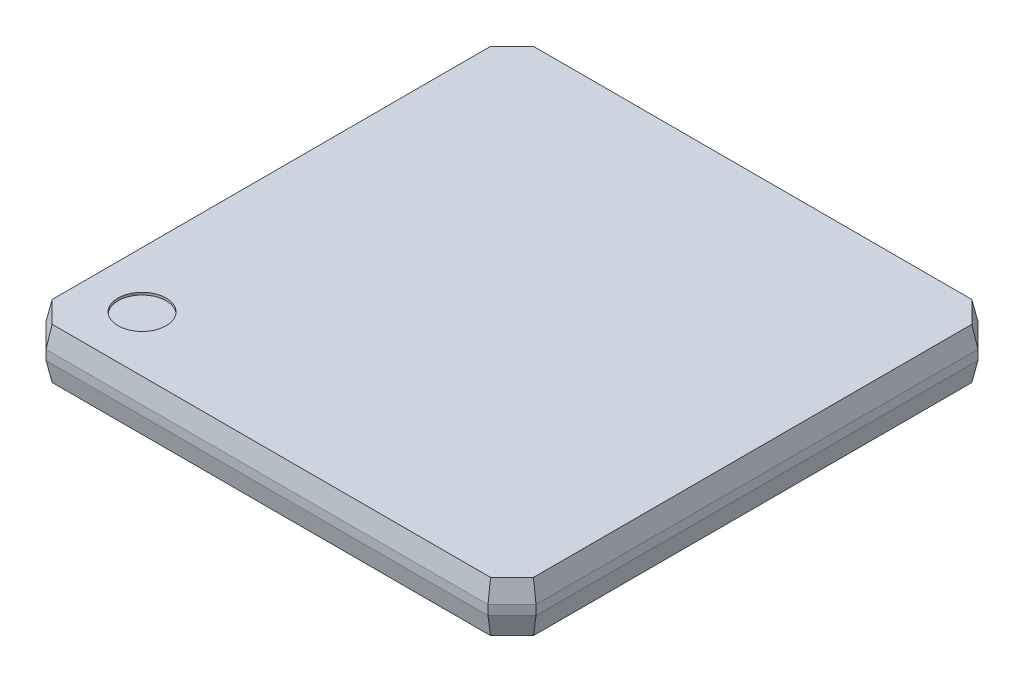
ISO-10303-21;
HEADER;
FILE_DESCRIPTION(('STEP AP214'),'2;1');
FILE_NAME('part.step','',(''),(''),'','','');
FILE_SCHEMA(('AUTOMOTIVE_DESIGN { 1 0 10303 214 1 1 1 1 }'));
ENDSEC;
DATA;
#1=APPLICATION_CONTEXT('core data for automotive mechanical design processes');
#2=APPLICATION_PROTOCOL_DEFINITION('international standard','automotive_design',2000,#1);
#3=PRODUCT_CONTEXT('',#1,'mechanical');
#4=PRODUCT('Part','Part','',(#3));
#5=PRODUCT_RELATED_PRODUCT_CATEGORY('part','',(#4));
#6=PRODUCT_DEFINITION_FORMATION('','',#4);
#7=PRODUCT_DEFINITION_CONTEXT('part definition',#1,'design');
#8=PRODUCT_DEFINITION('design','',#6,#7);
#9=PRODUCT_DEFINITION_SHAPE('','',#8);
#10=(LENGTH_UNIT() NAMED_UNIT(*) SI_UNIT(.MILLI.,.METRE.));
#11=(NAMED_UNIT(*) PLANE_ANGLE_UNIT() SI_UNIT($,.RADIAN.));
#12=(NAMED_UNIT(*) SI_UNIT($,.STERADIAN.) SOLID_ANGLE_UNIT());
#13=UNCERTAINTY_MEASURE_WITH_UNIT(LENGTH_MEASURE(1.E-05),#10,'distance_accuracy_value','');
#14=(GEOMETRIC_REPRESENTATION_CONTEXT(3) GLOBAL_UNCERTAINTY_ASSIGNED_CONTEXT((#13)) GLOBAL_UNIT_ASSIGNED_CONTEXT((#10,
#11,#12)) REPRESENTATION_CONTEXT('',''));
#15=CARTESIAN_POINT('',(0.,0.,0.));
#16=DIRECTION('',(0.,0.,1.));
#17=DIRECTION('',(1.,0.,0.));
#18=AXIS2_PLACEMENT_3D('',#15,#16,#17);
#19=CARTESIAN_POINT('',(-3.85,0.475,3.85));
#20=DIRECTION('',(0.,1.,0.));
#21=DIRECTION('',(0.,0.,1.));
#22=AXIS2_PLACEMENT_3D('',#19,#20,#21);
#23=PLANE('',#22);
#24=CARTESIAN_POINT('',(-3.85,0.475,3.85));
#25=DIRECTION('',(0.,1.,0.));
#26=DIRECTION('',(0.,0.,1.));
#27=AXIS2_PLACEMENT_3D('',#24,#25,#26);
#28=CIRCLE('',#27,0.500000000000001);
#29=CARTESIAN_POINT('',(-3.85,0.475,4.35));
#30=VERTEX_POINT('',#29);
#31=EDGE_CURVE('E19',#30,#30,#28,.T.);
#32=ORIENTED_EDGE('',*,*,#31,.T.);
#33=EDGE_LOOP('',(#32));
#34=FACE_BOUND('',#33,.T.);
#35=ADVANCED_FACE('F16',(#34),#23,.T.);
#36=CARTESIAN_POINT('',(-3.85,0.475,3.85));
#37=DIRECTION('',(0.,1.,0.));
#38=DIRECTION('',(0.,0.,1.));
#39=AXIS2_PLACEMENT_3D('',#36,#37,#38);
#40=CYLINDRICAL_SURFACE('',#39,0.500000000000001);
#41=ORIENTED_EDGE('',*,*,#31,.F.);
#42=EDGE_LOOP('',(#41));
#43=FACE_BOUND('',#42,.T.);
#44=CARTESIAN_POINT('',(-3.85,0.525,3.85));
#45=DIRECTION('',(0.,1.,0.));
#46=DIRECTION('',(0.,0.,1.));
#47=AXIS2_PLACEMENT_3D('',#44,#45,#46);
#48=CIRCLE('',#47,0.500000000000001);
#49=CARTESIAN_POINT('',(-3.85,0.525,4.35));
#50=VERTEX_POINT('',#49);
#51=EDGE_CURVE('E146',#50,#50,#48,.T.);
#52=ORIENTED_EDGE('',*,*,#51,.T.);
#53=EDGE_LOOP('',(#52));
#54=FACE_BOUND('',#53,.T.);
#55=ADVANCED_FACE('F161',(#43,#54),#40,.F.);
#56=CARTESIAN_POINT('',(5.1,0.525,-5.1));
#57=DIRECTION('',(0.,-1.,0.));
#58=DIRECTION('',(0.,0.,-1.));
#59=AXIS2_PLACEMENT_3D('',#56,#57,#58);
#60=PLANE('',#59);
#61=ORIENTED_EDGE('',*,*,#51,.F.);
#62=EDGE_LOOP('',(#61));
#63=FACE_BOUND('',#62,.T.);
#64=DIRECTION('',(1.,0.,0.));
#65=VECTOR('',#64,1.);
#66=CARTESIAN_POINT('',(5.1,0.525,-5.00966346129024));
#67=LINE('',#66,#65);
#68=CARTESIAN_POINT('',(4.56258138048858,0.525,-5.00966346129024));
#69=VERTEX_POINT('',#68);
#70=CARTESIAN_POINT('',(-4.56258138048858,0.525,-5.00966346129024));
#71=VERTEX_POINT('',#70);
#72=EDGE_CURVE('E581',#69,#71,#67,.F.);
#73=ORIENTED_EDGE('',*,*,#72,.T.);
#74=DIRECTION('',(0.707106781186547,0.,-0.707106781186548));
#75=VECTOR('',#74,1.);
#76=CARTESIAN_POINT('',(0.313877579110583,0.525,-9.88612242088941));
#77=LINE('',#76,#75);
#78=CARTESIAN_POINT('',(-5.00966346129024,0.525,-4.56258138048857));
#79=VERTEX_POINT('',#78);
#80=EDGE_CURVE('E538',#71,#79,#77,.F.);
#81=ORIENTED_EDGE('',*,*,#80,.T.);
#82=DIRECTION('',(0.,0.,1.));
#83=VECTOR('',#82,1.);
#84=CARTESIAN_POINT('',(-5.00966346129024,0.525,-5.1));
#85=LINE('',#84,#83);
#86=CARTESIAN_POINT('',(-5.00966346129024,0.525,4.56258138048858));
#87=VERTEX_POINT('',#86);
#88=EDGE_CURVE('E137',#79,#87,#85,.T.);
#89=ORIENTED_EDGE('',*,*,#88,.T.);
#90=DIRECTION('',(-0.707106781186548,0.,-0.707106781186548));
#91=VECTOR('',#90,1.);
#92=CARTESIAN_POINT('',(-4.78612242088941,0.525,4.78612242088941));
#93=LINE('',#92,#91);
#94=CARTESIAN_POINT('',(-4.56258138048858,0.525,5.00966346129024));
#95=VERTEX_POINT('',#94);
#96=EDGE_CURVE('E127',#87,#95,#93,.F.);
#97=ORIENTED_EDGE('',*,*,#96,.T.);
#98=DIRECTION('',(1.,0.,0.));
#99=VECTOR('',#98,1.);
#100=CARTESIAN_POINT('',(5.1,0.525,5.00966346129024));
#101=LINE('',#100,#99);
#102=CARTESIAN_POINT('',(4.56258138048858,0.525,5.00966346129024));
#103=VERTEX_POINT('',#102);
#104=EDGE_CURVE('E134',#95,#103,#101,.T.);
#105=ORIENTED_EDGE('',*,*,#104,.T.);
#106=DIRECTION('',(-0.707106781186548,0.,0.707106781186548));
#107=VECTOR('',#106,1.);
#108=CARTESIAN_POINT('',(5.00966346129024,0.525,4.56258138048858));
#109=LINE('',#108,#107);
#110=CARTESIAN_POINT('',(5.00966346129024,0.525,4.56258138048858));
#111=VERTEX_POINT('',#110);
#112=EDGE_CURVE('E157',#111,#103,#109,.T.);
#113=ORIENTED_EDGE('',*,*,#112,.F.);
#114=DIRECTION('',(0.,0.,1.));
#115=VECTOR('',#114,1.);
#116=CARTESIAN_POINT('',(5.00966346129024,0.525,-5.1));
#117=LINE('',#116,#115);
#118=CARTESIAN_POINT('',(5.00966346129024,0.525,-4.56258138048857));
#119=VERTEX_POINT('',#118);
#120=EDGE_CURVE('E575',#111,#119,#117,.F.);
#121=ORIENTED_EDGE('',*,*,#120,.T.);
#122=DIRECTION('',(0.707106781186547,0.,0.707106781186548));
#123=VECTOR('',#122,1.);
#124=CARTESIAN_POINT('',(4.78612242088941,0.525,-4.78612242088941));
#125=LINE('',#124,#123);
#126=EDGE_CURVE('E579',#119,#69,#125,.F.);
#127=ORIENTED_EDGE('',*,*,#126,.T.);
#128=EDGE_LOOP('',(#73,#81,#89,#97,#105,#113,#121,#127));
#129=FACE_BOUND('',#128,.T.);
#130=ADVANCED_FACE('F133',(#63,#129),#60,.F.);
#131=CARTESIAN_POINT('',(5.1,0.525,5.00966346129024));
#132=DIRECTION('',(0.,-0.207911690817756,-0.978147600733806));
#133=DIRECTION('',(0.,0.978147600733806,-0.207911690817756));
#134=AXIS2_PLACEMENT_3D('',#131,#132,#133);
#135=PLANE('',#134);
#136=DIRECTION('',(-0.0858022482493047,0.974540375409119,-0.207144951405574));
#137=VECTOR('',#136,1.);
#138=CARTESIAN_POINT('',(4.6,0.099999999999995,5.1));
#139=LINE('',#138,#137);
#140=CARTESIAN_POINT('',(4.6,0.0999999999999948,5.1));
#141=VERTEX_POINT('',#140);
#142=EDGE_CURVE('E145',#141,#103,#139,.T.);
#143=ORIENTED_EDGE('',*,*,#142,.T.);
#144=ORIENTED_EDGE('',*,*,#104,.F.);
#145=DIRECTION('',(-0.0858022482492987,-0.97454037540912,0.207144951405576));
#146=VECTOR('',#145,1.);
#147=CARTESIAN_POINT('',(-4.56258138048858,0.525,5.00966346129024));
#148=LINE('',#147,#146);
#149=CARTESIAN_POINT('',(-4.6,0.0999999999999947,5.1));
#150=VERTEX_POINT('',#149);
#151=EDGE_CURVE('E139',#95,#150,#148,.T.);
#152=ORIENTED_EDGE('',*,*,#151,.T.);
#153=DIRECTION('',(-1.,0.,0.));
#154=VECTOR('',#153,1.);
#155=CARTESIAN_POINT('',(-4.6,0.0999999999999947,5.1));
#156=LINE('',#155,#154);
#157=EDGE_CURVE('E568',#150,#141,#156,.F.);
#158=ORIENTED_EDGE('',*,*,#157,.T.);
#159=EDGE_LOOP('',(#143,#144,#152,#158));
#160=FACE_BOUND('',#159,.T.);
#161=ADVANCED_FACE('F142',(#160),#135,.F.);
#162=CARTESIAN_POINT('',(-4.78612242088941,0.525,4.78612242088941));
#163=DIRECTION('',(0.691654801480226,-0.207911690817754,-0.691654801480226));
#164=DIRECTION('',(-0.707106781186548,0.,-0.707106781186548));
#165=AXIS2_PLACEMENT_3D('',#162,#163,#164);
#166=PLANE('',#165);
#167=ORIENTED_EDGE('',*,*,#151,.F.);
#168=ORIENTED_EDGE('',*,*,#96,.F.);
#169=DIRECTION('',(-0.207144951405572,-0.97454037540912,0.0858022482492987));
#170=VECTOR('',#169,1.);
#171=CARTESIAN_POINT('',(-5.00966346129024,0.525,4.56258138048858));
#172=LINE('',#171,#170);
#173=CARTESIAN_POINT('',(-5.1,0.0999999999999947,4.6));
#174=VERTEX_POINT('',#173);
#175=EDGE_CURVE('E152',#87,#174,#172,.T.);
#176=ORIENTED_EDGE('',*,*,#175,.T.);
#177=DIRECTION('',(-0.707106781186548,0.,-0.707106781186548));
#178=VECTOR('',#177,1.);
#179=CARTESIAN_POINT('',(-5.1,0.0999999999999946,4.6));
#180=LINE('',#179,#178);
#181=EDGE_CURVE('E150',#174,#150,#180,.F.);
#182=ORIENTED_EDGE('',*,*,#181,.T.);
#183=EDGE_LOOP('',(#167,#168,#176,#182));
#184=FACE_BOUND('',#183,.T.);
#185=ADVANCED_FACE('F148',(#184),#166,.F.);
#186=CARTESIAN_POINT('',(-5.00966346129024,0.525,-5.1));
#187=DIRECTION('',(0.978147600733806,-0.207911690817756,0.));
#188=DIRECTION('',(0.207911690817756,0.978147600733806,0.));
#189=AXIS2_PLACEMENT_3D('',#186,#187,#188);
#190=PLANE('',#189);
#191=DIRECTION('',(-0.207144951405578,-0.974540375409119,-0.0858022482492987));
#192=VECTOR('',#191,1.);
#193=CARTESIAN_POINT('',(-5.00966346129024,0.525,-4.56258138048857));
#194=LINE('',#193,#192);
#195=CARTESIAN_POINT('',(-5.1,0.099999999999995,-4.6));
#196=VERTEX_POINT('',#195);
#197=EDGE_CURVE('E534',#79,#196,#194,.T.);
#198=ORIENTED_EDGE('',*,*,#197,.T.);
#199=DIRECTION('',(0.,0.,-1.));
#200=VECTOR('',#199,1.);
#201=CARTESIAN_POINT('',(-5.1,0.099999999999995,-4.6));
#202=LINE('',#201,#200);
#203=EDGE_CURVE('E537',#196,#174,#202,.F.);
#204=ORIENTED_EDGE('',*,*,#203,.T.);
#205=ORIENTED_EDGE('',*,*,#175,.F.);
#206=ORIENTED_EDGE('',*,*,#88,.F.);
#207=EDGE_LOOP('',(#198,#204,#205,#206));
#208=FACE_BOUND('',#207,.T.);
#209=ADVANCED_FACE('F262',(#208),#190,.F.);
#210=CARTESIAN_POINT('',(0.313877579110583,0.525,-9.88612242088941));
#211=DIRECTION('',(0.691654801480227,-0.207911690817755,0.691654801480226));
#212=DIRECTION('',(0.707106781186547,0.,-0.707106781186548));
#213=AXIS2_PLACEMENT_3D('',#210,#211,#212);
#214=PLANE('',#213);
#215=DIRECTION('',(-0.0858022482492988,-0.97454037540912,-0.207144951405572));
#216=VECTOR('',#215,1.);
#217=CARTESIAN_POINT('',(-4.56258138048858,0.525,-5.00966346129024));
#218=LINE('',#217,#216);
#219=CARTESIAN_POINT('',(-4.6,0.099999999999995,-5.1));
#220=VERTEX_POINT('',#219);
#221=EDGE_CURVE('E543',#71,#220,#218,.T.);
#222=ORIENTED_EDGE('',*,*,#221,.T.);
#223=DIRECTION('',(0.707106781186547,0.,-0.707106781186548));
#224=VECTOR('',#223,1.);
#225=CARTESIAN_POINT('',(-5.1,0.099999999999995,-4.6));
#226=LINE('',#225,#224);
#227=EDGE_CURVE('E541',#220,#196,#226,.F.);
#228=ORIENTED_EDGE('',*,*,#227,.T.);
#229=ORIENTED_EDGE('',*,*,#197,.F.);
#230=ORIENTED_EDGE('',*,*,#80,.F.);
#231=EDGE_LOOP('',(#222,#228,#229,#230));
#232=FACE_BOUND('',#231,.T.);
#233=ADVANCED_FACE('F258',(#232),#214,.F.);
#234=CARTESIAN_POINT('',(5.1,0.525,-5.00966346129024));
#235=DIRECTION('',(0.,-0.207911690817756,0.978147600733806));
#236=DIRECTION('',(0.,-0.978147600733806,-0.207911690817756));
#237=AXIS2_PLACEMENT_3D('',#234,#235,#236);
#238=PLANE('',#237);
#239=DIRECTION('',(0.0858022482493007,-0.97454037540912,-0.207144951405572));
#240=VECTOR('',#239,1.);
#241=CARTESIAN_POINT('',(4.56258138048858,0.525,-5.00966346129024));
#242=LINE('',#241,#240);
#243=CARTESIAN_POINT('',(4.6,0.0999999999999948,-5.1));
#244=VERTEX_POINT('',#243);
#245=EDGE_CURVE('E577',#69,#244,#242,.T.);
#246=ORIENTED_EDGE('',*,*,#245,.T.);
#247=DIRECTION('',(1.,0.,0.));
#248=VECTOR('',#247,1.);
#249=CARTESIAN_POINT('',(-4.6,0.0999999999999948,-5.1));
#250=LINE('',#249,#248);
#251=EDGE_CURVE('E559',#244,#220,#250,.F.);
#252=ORIENTED_EDGE('',*,*,#251,.T.);
#253=ORIENTED_EDGE('',*,*,#221,.F.);
#254=ORIENTED_EDGE('',*,*,#72,.F.);
#255=EDGE_LOOP('',(#246,#252,#253,#254));
#256=FACE_BOUND('',#255,.T.);
#257=ADVANCED_FACE('F254',(#256),#238,.F.);
#258=CARTESIAN_POINT('',(4.78612242088941,0.525,-4.78612242088941));
#259=DIRECTION('',(-0.691654801480227,-0.207911690817755,0.691654801480226));
#260=DIRECTION('',(0.707106781186547,0.,0.707106781186548));
#261=AXIS2_PLACEMENT_3D('',#258,#259,#260);
#262=PLANE('',#261);
#263=ORIENTED_EDGE('',*,*,#245,.F.);
#264=ORIENTED_EDGE('',*,*,#126,.F.);
#265=DIRECTION('',(0.20714495140557,-0.97454037540912,-0.0858022482493047));
#266=VECTOR('',#265,1.);
#267=CARTESIAN_POINT('',(5.00966346129024,0.525,-4.56258138048857));
#268=LINE('',#267,#266);
#269=CARTESIAN_POINT('',(5.1,0.0999999999999947,-4.6));
#270=VERTEX_POINT('',#269);
#271=EDGE_CURVE('E573',#119,#270,#268,.T.);
#272=ORIENTED_EDGE('',*,*,#271,.T.);
#273=DIRECTION('',(0.707106781186547,0.,0.707106781186548));
#274=VECTOR('',#273,1.);
#275=CARTESIAN_POINT('',(4.6,0.0999999999999947,-5.1));
#276=LINE('',#275,#274);
#277=EDGE_CURVE('E595',#270,#244,#276,.F.);
#278=ORIENTED_EDGE('',*,*,#277,.T.);
#279=EDGE_LOOP('',(#263,#264,#272,#278));
#280=FACE_BOUND('',#279,.T.);
#281=ADVANCED_FACE('F250',(#280),#262,.F.);
#282=CARTESIAN_POINT('',(5.00966346129024,0.525,-5.1));
#283=DIRECTION('',(-0.978147600733807,-0.207911690817754,0.));
#284=DIRECTION('',(0.207911690817754,-0.978147600733807,0.));
#285=AXIS2_PLACEMENT_3D('',#282,#283,#284);
#286=PLANE('',#285);
#287=ORIENTED_EDGE('',*,*,#271,.F.);
#288=ORIENTED_EDGE('',*,*,#120,.F.);
#289=DIRECTION('',(0.207144951405574,-0.974540375409119,0.0858022482493048));
#290=VECTOR('',#289,1.);
#291=CARTESIAN_POINT('',(5.00966346129024,0.525,4.56258138048858));
#292=LINE('',#291,#290);
#293=CARTESIAN_POINT('',(5.1,0.0999999999999949,4.6));
#294=VERTEX_POINT('',#293);
#295=EDGE_CURVE('E570',#111,#294,#292,.T.);
#296=ORIENTED_EDGE('',*,*,#295,.T.);
#297=DIRECTION('',(0.,0.,1.));
#298=VECTOR('',#297,1.);
#299=CARTESIAN_POINT('',(5.1,0.099999999999995,-4.6));
#300=LINE('',#299,#298);
#301=EDGE_CURVE('E600',#294,#270,#300,.F.);
#302=ORIENTED_EDGE('',*,*,#301,.T.);
#303=EDGE_LOOP('',(#287,#288,#296,#302));
#304=FACE_BOUND('',#303,.T.);
#305=ADVANCED_FACE('F246',(#304),#286,.F.);
#306=CARTESIAN_POINT('',(9.88612242088941,0.525,-0.313877579110589));
#307=DIRECTION('',(-0.691654801480226,-0.207911690817757,-0.691654801480226));
#308=DIRECTION('',(-0.707106781186547,0.,0.707106781186547));
#309=AXIS2_PLACEMENT_3D('',#306,#307,#308);
#310=PLANE('',#309);
#311=ORIENTED_EDGE('',*,*,#295,.F.);
#312=ORIENTED_EDGE('',*,*,#112,.T.);
#313=ORIENTED_EDGE('',*,*,#142,.F.);
#314=DIRECTION('',(-0.707106781186548,0.,0.707106781186548));
#315=VECTOR('',#314,1.);
#316=CARTESIAN_POINT('',(4.6,0.0999999999999946,5.1));
#317=LINE('',#316,#315);
#318=EDGE_CURVE('E639',#141,#294,#317,.F.);
#319=ORIENTED_EDGE('',*,*,#318,.T.);
#320=EDGE_LOOP('',(#311,#312,#313,#319));
#321=FACE_BOUND('',#320,.T.);
#322=ADVANCED_FACE('F242',(#321),#310,.F.);
#323=CARTESIAN_POINT('',(-4.6,0.525,5.1));
#324=DIRECTION('',(0.,0.,-1.));
#325=DIRECTION('',(-1.,0.,0.));
#326=AXIS2_PLACEMENT_3D('',#323,#324,#325);
#327=PLANE('',#326);
#328=DIRECTION('',(0.,1.,0.));
#329=VECTOR('',#328,1.);
#330=CARTESIAN_POINT('',(4.6,0.525,5.1));
#331=LINE('',#330,#329);
#332=CARTESIAN_POINT('',(4.6,-0.0999999999999951,5.1));
#333=VERTEX_POINT('',#332);
#334=EDGE_CURVE('E642',#333,#141,#331,.T.);
#335=ORIENTED_EDGE('',*,*,#334,.T.);
#336=ORIENTED_EDGE('',*,*,#157,.F.);
#337=DIRECTION('',(0.,1.,0.));
#338=VECTOR('',#337,1.);
#339=CARTESIAN_POINT('',(-4.6,0.525,5.1));
#340=LINE('',#339,#338);
#341=CARTESIAN_POINT('',(-4.6,-0.099999999999995,5.1));
#342=VERTEX_POINT('',#341);
#343=EDGE_CURVE('E553',#150,#342,#340,.F.);
#344=ORIENTED_EDGE('',*,*,#343,.T.);
#345=DIRECTION('',(1.,0.,0.));
#346=VECTOR('',#345,1.);
#347=CARTESIAN_POINT('',(-4.6,-0.099999999999995,5.1));
#348=LINE('',#347,#346);
#349=EDGE_CURVE('E634',#333,#342,#348,.F.);
#350=ORIENTED_EDGE('',*,*,#349,.F.);
#351=EDGE_LOOP('',(#335,#336,#344,#350));
#352=FACE_BOUND('',#351,.T.);
#353=ADVANCED_FACE('F238',(#352),#327,.F.);
#354=CARTESIAN_POINT('',(-5.1,0.525,4.6));
#355=DIRECTION('',(0.707106781186548,0.,-0.707106781186548));
#356=DIRECTION('',(-0.707106781186548,0.,-0.707106781186548));
#357=AXIS2_PLACEMENT_3D('',#354,#355,#356);
#358=PLANE('',#357);
#359=ORIENTED_EDGE('',*,*,#343,.F.);
#360=ORIENTED_EDGE('',*,*,#181,.F.);
#361=DIRECTION('',(0.,1.,0.));
#362=VECTOR('',#361,1.);
#363=CARTESIAN_POINT('',(-5.1,0.525,4.6));
#364=LINE('',#363,#362);
#365=CARTESIAN_POINT('',(-5.1,-0.099999999999995,4.6));
#366=VERTEX_POINT('',#365);
#367=EDGE_CURVE('E548',#174,#366,#364,.F.);
#368=ORIENTED_EDGE('',*,*,#367,.T.);
#369=DIRECTION('',(0.707106781186548,0.,0.707106781186548));
#370=VECTOR('',#369,1.);
#371=CARTESIAN_POINT('',(-5.1,-0.0999999999999949,4.6));
#372=LINE('',#371,#370);
#373=EDGE_CURVE('E628',#342,#366,#372,.F.);
#374=ORIENTED_EDGE('',*,*,#373,.F.);
#375=EDGE_LOOP('',(#359,#360,#368,#374));
#376=FACE_BOUND('',#375,.T.);
#377=ADVANCED_FACE('F234',(#376),#358,.F.);
#378=CARTESIAN_POINT('',(-5.1,0.525,-4.6));
#379=DIRECTION('',(1.,0.,0.));
#380=DIRECTION('',(0.,0.,-1.));
#381=AXIS2_PLACEMENT_3D('',#378,#379,#380);
#382=PLANE('',#381);
#383=ORIENTED_EDGE('',*,*,#367,.F.);
#384=ORIENTED_EDGE('',*,*,#203,.F.);
#385=DIRECTION('',(0.,1.,0.));
#386=VECTOR('',#385,1.);
#387=CARTESIAN_POINT('',(-5.1,0.525,-4.6));
#388=LINE('',#387,#386);
#389=CARTESIAN_POINT('',(-5.1,-0.099999999999995,-4.6));
#390=VERTEX_POINT('',#389);
#391=EDGE_CURVE('E547',#196,#390,#388,.F.);
#392=ORIENTED_EDGE('',*,*,#391,.T.);
#393=DIRECTION('',(0.,0.,1.));
#394=VECTOR('',#393,1.);
#395=CARTESIAN_POINT('',(-5.1,-0.0999999999999951,-4.6));
#396=LINE('',#395,#394);
#397=EDGE_CURVE('E623',#366,#390,#396,.F.);
#398=ORIENTED_EDGE('',*,*,#397,.F.);
#399=EDGE_LOOP('',(#383,#384,#392,#398));
#400=FACE_BOUND('',#399,.T.);
#401=ADVANCED_FACE('F230',(#400),#382,.F.);
#402=CARTESIAN_POINT('',(-5.1,0.525,-4.6));
#403=DIRECTION('',(0.707106781186548,0.,0.707106781186547));
#404=DIRECTION('',(0.707106781186547,0.,-0.707106781186548));
#405=AXIS2_PLACEMENT_3D('',#402,#403,#404);
#406=PLANE('',#405);
#407=ORIENTED_EDGE('',*,*,#391,.F.);
#408=ORIENTED_EDGE('',*,*,#227,.F.);
#409=DIRECTION('',(0.,1.,0.));
#410=VECTOR('',#409,1.);
#411=CARTESIAN_POINT('',(-4.6,0.525,-5.1));
#412=LINE('',#411,#410);
#413=CARTESIAN_POINT('',(-4.6,-0.0999999999999949,-5.1));
#414=VERTEX_POINT('',#413);
#415=EDGE_CURVE('E561',#220,#414,#412,.F.);
#416=ORIENTED_EDGE('',*,*,#415,.T.);
#417=DIRECTION('',(-0.707106781186547,0.,0.707106781186548));
#418=VECTOR('',#417,1.);
#419=CARTESIAN_POINT('',(-5.1,-0.0999999999999949,-4.6));
#420=LINE('',#419,#418);
#421=EDGE_CURVE('E557',#390,#414,#420,.F.);
#422=ORIENTED_EDGE('',*,*,#421,.F.);
#423=EDGE_LOOP('',(#407,#408,#416,#422));
#424=FACE_BOUND('',#423,.T.);
#425=ADVANCED_FACE('F226',(#424),#406,.F.);
#426=CARTESIAN_POINT('',(-4.6,0.525,-5.1));
#427=DIRECTION('',(0.,0.,1.));
#428=DIRECTION('',(1.,0.,0.));
#429=AXIS2_PLACEMENT_3D('',#426,#427,#428);
#430=PLANE('',#429);
#431=ORIENTED_EDGE('',*,*,#415,.F.);
#432=ORIENTED_EDGE('',*,*,#251,.F.);
#433=DIRECTION('',(0.,1.,0.));
#434=VECTOR('',#433,1.);
#435=CARTESIAN_POINT('',(4.6,0.525,-5.1));
#436=LINE('',#435,#434);
#437=CARTESIAN_POINT('',(4.6,-0.0999999999999949,-5.1));
#438=VERTEX_POINT('',#437);
#439=EDGE_CURVE('E591',#244,#438,#436,.F.);
#440=ORIENTED_EDGE('',*,*,#439,.T.);
#441=DIRECTION('',(1.,0.,0.));
#442=VECTOR('',#441,1.);
#443=CARTESIAN_POINT('',(-4.6,-0.0999999999999948,-5.1));
#444=LINE('',#443,#442);
#445=EDGE_CURVE('E613',#414,#438,#444,.T.);
#446=ORIENTED_EDGE('',*,*,#445,.F.);
#447=EDGE_LOOP('',(#431,#432,#440,#446));
#448=FACE_BOUND('',#447,.T.);
#449=ADVANCED_FACE('F222',(#448),#430,.F.);
#450=CARTESIAN_POINT('',(4.6,0.525,-5.1));
#451=DIRECTION('',(-0.707106781186548,0.,0.707106781186547));
#452=DIRECTION('',(0.707106781186547,0.,0.707106781186548));
#453=AXIS2_PLACEMENT_3D('',#450,#451,#452);
#454=PLANE('',#453);
#455=ORIENTED_EDGE('',*,*,#439,.F.);
#456=ORIENTED_EDGE('',*,*,#277,.F.);
#457=DIRECTION('',(0.,1.,0.));
#458=VECTOR('',#457,1.);
#459=CARTESIAN_POINT('',(5.1,0.525,-4.6));
#460=LINE('',#459,#458);
#461=CARTESIAN_POINT('',(5.1,-0.0999999999999948,-4.6));
#462=VERTEX_POINT('',#461);
#463=EDGE_CURVE('E603',#270,#462,#460,.F.);
#464=ORIENTED_EDGE('',*,*,#463,.T.);
#465=DIRECTION('',(-0.707106781186547,0.,-0.707106781186548));
#466=VECTOR('',#465,1.);
#467=CARTESIAN_POINT('',(4.6,-0.0999999999999949,-5.1));
#468=LINE('',#467,#466);
#469=EDGE_CURVE('E598',#438,#462,#468,.F.);
#470=ORIENTED_EDGE('',*,*,#469,.F.);
#471=EDGE_LOOP('',(#455,#456,#464,#470));
#472=FACE_BOUND('',#471,.T.);
#473=ADVANCED_FACE('F218',(#472),#454,.F.);
#474=CARTESIAN_POINT('',(5.1,0.525,-4.6));
#475=DIRECTION('',(-1.,0.,0.));
#476=DIRECTION('',(0.,0.,1.));
#477=AXIS2_PLACEMENT_3D('',#474,#475,#476);
#478=PLANE('',#477);
#479=ORIENTED_EDGE('',*,*,#463,.F.);
#480=ORIENTED_EDGE('',*,*,#301,.F.);
#481=DIRECTION('',(0.,1.,0.));
#482=VECTOR('',#481,1.);
#483=CARTESIAN_POINT('',(5.1,0.525,4.6));
#484=LINE('',#483,#482);
#485=CARTESIAN_POINT('',(5.1,-0.0999999999999949,4.6));
#486=VERTEX_POINT('',#485);
#487=EDGE_CURVE('E637',#294,#486,#484,.F.);
#488=ORIENTED_EDGE('',*,*,#487,.T.);
#489=DIRECTION('',(0.,0.,1.));
#490=VECTOR('',#489,1.);
#491=CARTESIAN_POINT('',(5.1,-0.0999999999999948,-4.6));
#492=LINE('',#491,#490);
#493=EDGE_CURVE('E650',#462,#486,#492,.T.);
#494=ORIENTED_EDGE('',*,*,#493,.F.);
#495=EDGE_LOOP('',(#479,#480,#488,#494));
#496=FACE_BOUND('',#495,.T.);
#497=ADVANCED_FACE('F214',(#496),#478,.F.);
#498=CARTESIAN_POINT('',(4.6,0.525,5.1));
#499=DIRECTION('',(-0.707106781186548,0.,-0.707106781186548));
#500=DIRECTION('',(-0.707106781186548,0.,0.707106781186548));
#501=AXIS2_PLACEMENT_3D('',#498,#499,#500);
#502=PLANE('',#501);
#503=ORIENTED_EDGE('',*,*,#487,.F.);
#504=ORIENTED_EDGE('',*,*,#318,.F.);
#505=ORIENTED_EDGE('',*,*,#334,.F.);
#506=DIRECTION('',(0.707106781186547,0.,-0.707106781186547));
#507=VECTOR('',#506,1.);
#508=CARTESIAN_POINT('',(4.6,-0.0999999999999949,5.1));
#509=LINE('',#508,#507);
#510=EDGE_CURVE('E658',#486,#333,#509,.F.);
#511=ORIENTED_EDGE('',*,*,#510,.F.);
#512=EDGE_LOOP('',(#503,#504,#505,#511));
#513=FACE_BOUND('',#512,.T.);
#514=ADVANCED_FACE('F210',(#513),#502,.F.);
#515=CARTESIAN_POINT('',(-4.6,-0.0999999999999948,5.1));
#516=DIRECTION('',(0.,-0.207911690817756,0.978147600733806));
#517=DIRECTION('',(0.,-0.978147600733806,-0.207911690817756));
#518=AXIS2_PLACEMENT_3D('',#515,#516,#517);
#519=PLANE('',#518);
#520=DIRECTION('',(-0.0858022482493047,-0.974540375409119,-0.207144951405574));
#521=VECTOR('',#520,1.);
#522=CARTESIAN_POINT('',(4.6,-0.099999999999995,5.1));
#523=LINE('',#522,#521);
#524=CARTESIAN_POINT('',(4.56258138048858,-0.525,5.00966346129024));
#525=VERTEX_POINT('',#524);
#526=EDGE_CURVE('E661',#333,#525,#523,.T.);
#527=ORIENTED_EDGE('',*,*,#526,.F.);
#528=ORIENTED_EDGE('',*,*,#349,.T.);
#529=DIRECTION('',(-0.0858022482492968,0.97454037540912,0.207144951405574));
#530=VECTOR('',#529,1.);
#531=CARTESIAN_POINT('',(-4.56258138048858,-0.525,5.00966346129024));
#532=LINE('',#531,#530);
#533=CARTESIAN_POINT('',(-4.56258138048858,-0.525,5.00966346129024));
#534=VERTEX_POINT('',#533);
#535=EDGE_CURVE('E631',#534,#342,#532,.T.);
#536=ORIENTED_EDGE('',*,*,#535,.F.);
#537=DIRECTION('',(1.,0.,0.));
#538=VECTOR('',#537,1.);
#539=CARTESIAN_POINT('',(5.1,-0.525,5.00966346129024));
#540=LINE('',#539,#538);
#541=EDGE_CURVE('E664',#525,#534,#540,.F.);
#542=ORIENTED_EDGE('',*,*,#541,.F.);
#543=EDGE_LOOP('',(#527,#528,#536,#542));
#544=FACE_BOUND('',#543,.T.);
#545=ADVANCED_FACE('F206',(#544),#519,.T.);
#546=CARTESIAN_POINT('',(-5.1,-0.0999999999999948,4.6));
#547=DIRECTION('',(-0.691654801480226,-0.207911690817754,0.691654801480226));
#548=DIRECTION('',(0.707106781186548,0.,0.707106781186548));
#549=AXIS2_PLACEMENT_3D('',#546,#547,#548);
#550=PLANE('',#549);
#551=ORIENTED_EDGE('',*,*,#535,.T.);
#552=ORIENTED_EDGE('',*,*,#373,.T.);
#553=DIRECTION('',(-0.207144951405572,0.974540375409121,0.0858022482492949));
#554=VECTOR('',#553,1.);
#555=CARTESIAN_POINT('',(-5.00966346129024,-0.525,4.56258138048858));
#556=LINE('',#555,#554);
#557=CARTESIAN_POINT('',(-5.00966346129024,-0.525,4.56258138048858));
#558=VERTEX_POINT('',#557);
#559=EDGE_CURVE('E625',#558,#366,#556,.T.);
#560=ORIENTED_EDGE('',*,*,#559,.F.);
#561=DIRECTION('',(-0.707106781186548,0.,-0.707106781186548));
#562=VECTOR('',#561,1.);
#563=CARTESIAN_POINT('',(-4.56258138048858,-0.525,5.00966346129024));
#564=LINE('',#563,#562);
#565=EDGE_CURVE('E667',#534,#558,#564,.T.);
#566=ORIENTED_EDGE('',*,*,#565,.F.);
#567=EDGE_LOOP('',(#551,#552,#560,#566));
#568=FACE_BOUND('',#567,.T.);
#569=ADVANCED_FACE('F202',(#568),#550,.T.);
#570=CARTESIAN_POINT('',(-5.1,-0.0999999999999948,-4.6));
#571=DIRECTION('',(-0.978147600733806,-0.207911690817756,0.));
#572=DIRECTION('',(0.207911690817756,-0.978147600733806,0.));
#573=AXIS2_PLACEMENT_3D('',#570,#571,#572);
#574=PLANE('',#573);
#575=ORIENTED_EDGE('',*,*,#559,.T.);
#576=ORIENTED_EDGE('',*,*,#397,.T.);
#577=DIRECTION('',(-0.207144951405572,0.97454037540912,-0.0858022482493027));
#578=VECTOR('',#577,1.);
#579=CARTESIAN_POINT('',(-5.00966346129024,-0.525,-4.56258138048857));
#580=LINE('',#579,#578);
#581=CARTESIAN_POINT('',(-5.00966346129024,-0.525,-4.56258138048857));
#582=VERTEX_POINT('',#581);
#583=EDGE_CURVE('E611',#582,#390,#580,.T.);
#584=ORIENTED_EDGE('',*,*,#583,.F.);
#585=DIRECTION('',(0.,0.,-1.));
#586=VECTOR('',#585,1.);
#587=CARTESIAN_POINT('',(-5.00966346129024,-0.525,-5.1));
#588=LINE('',#587,#586);
#589=EDGE_CURVE('E670',#558,#582,#588,.T.);
#590=ORIENTED_EDGE('',*,*,#589,.F.);
#591=EDGE_LOOP('',(#575,#576,#584,#590));
#592=FACE_BOUND('',#591,.T.);
#593=ADVANCED_FACE('F198',(#592),#574,.T.);
#594=CARTESIAN_POINT('',(-5.1,-0.0999999999999948,-4.6));
#595=DIRECTION('',(-0.691654801480227,-0.207911690817755,-0.691654801480226));
#596=DIRECTION('',(-0.707106781186547,0.,0.707106781186548));
#597=AXIS2_PLACEMENT_3D('',#594,#595,#596);
#598=PLANE('',#597);
#599=DIRECTION('',(-0.0858022482493008,0.97454037540912,-0.207144951405572));
#600=VECTOR('',#599,1.);
#601=CARTESIAN_POINT('',(-4.56258138048858,-0.525,-5.00966346129024));
#602=LINE('',#601,#600);
#603=CARTESIAN_POINT('',(-4.56258138048858,-0.525,-5.00966346129024));
#604=VERTEX_POINT('',#603);
#605=EDGE_CURVE('E609',#604,#414,#602,.T.);
#606=ORIENTED_EDGE('',*,*,#605,.F.);
#607=DIRECTION('',(0.707106781186547,0.,-0.707106781186548));
#608=VECTOR('',#607,1.);
#609=CARTESIAN_POINT('',(-5.00966346129024,-0.525,-4.56258138048857));
#610=LINE('',#609,#608);
#611=EDGE_CURVE('E673',#582,#604,#610,.T.);
#612=ORIENTED_EDGE('',*,*,#611,.F.);
#613=ORIENTED_EDGE('',*,*,#583,.T.);
#614=ORIENTED_EDGE('',*,*,#421,.T.);
#615=EDGE_LOOP('',(#606,#612,#613,#614));
#616=FACE_BOUND('',#615,.T.);
#617=ADVANCED_FACE('F194',(#616),#598,.T.);
#618=CARTESIAN_POINT('',(-4.6,-0.0999999999999948,-5.1));
#619=DIRECTION('',(0.,-0.207911690817756,-0.978147600733806));
#620=DIRECTION('',(0.,0.978147600733806,-0.207911690817756));
#621=AXIS2_PLACEMENT_3D('',#618,#619,#620);
#622=PLANE('',#621);
#623=DIRECTION('',(0.0858022482493007,0.97454037540912,-0.207144951405573));
#624=VECTOR('',#623,1.);
#625=CARTESIAN_POINT('',(4.56258138048858,-0.525,-5.00966346129024));
#626=LINE('',#625,#624);
#627=CARTESIAN_POINT('',(4.56258138048858,-0.525,-5.00966346129024));
#628=VERTEX_POINT('',#627);
#629=EDGE_CURVE('E614',#628,#438,#626,.T.);
#630=ORIENTED_EDGE('',*,*,#629,.F.);
#631=DIRECTION('',(1.,0.,0.));
#632=VECTOR('',#631,1.);
#633=CARTESIAN_POINT('',(5.1,-0.525,-5.00966346129024));
#634=LINE('',#633,#632);
#635=EDGE_CURVE('E617',#604,#628,#634,.T.);
#636=ORIENTED_EDGE('',*,*,#635,.F.);
#637=ORIENTED_EDGE('',*,*,#605,.T.);
#638=ORIENTED_EDGE('',*,*,#445,.T.);
#639=EDGE_LOOP('',(#630,#636,#637,#638));
#640=FACE_BOUND('',#639,.T.);
#641=ADVANCED_FACE('F190',(#640),#622,.T.);
#642=CARTESIAN_POINT('',(4.6,-0.0999999999999948,-5.1));
#643=DIRECTION('',(0.691654801480227,-0.207911690817755,-0.691654801480226));
#644=DIRECTION('',(-0.707106781186547,0.,-0.707106781186548));
#645=AXIS2_PLACEMENT_3D('',#642,#643,#644);
#646=PLANE('',#645);
#647=DIRECTION('',(0.20714495140557,0.97454037540912,-0.0858022482493047));
#648=VECTOR('',#647,1.);
#649=CARTESIAN_POINT('',(5.00966346129024,-0.525,-4.56258138048857));
#650=LINE('',#649,#648);
#651=CARTESIAN_POINT('',(5.00966346129024,-0.525,-4.56258138048857));
#652=VERTEX_POINT('',#651);
#653=EDGE_CURVE('E648',#652,#462,#650,.T.);
#654=ORIENTED_EDGE('',*,*,#653,.F.);
#655=DIRECTION('',(0.707106781186545,0.,0.70710678118655));
#656=VECTOR('',#655,1.);
#657=CARTESIAN_POINT('',(4.56258138048858,-0.525,-5.00966346129024));
#658=LINE('',#657,#656);
#659=EDGE_CURVE('E676',#628,#652,#658,.T.);
#660=ORIENTED_EDGE('',*,*,#659,.F.);
#661=ORIENTED_EDGE('',*,*,#629,.T.);
#662=ORIENTED_EDGE('',*,*,#469,.T.);
#663=EDGE_LOOP('',(#654,#660,#661,#662));
#664=FACE_BOUND('',#663,.T.);
#665=ADVANCED_FACE('F187',(#664),#646,.T.);
#666=CARTESIAN_POINT('',(5.1,-0.0999999999999948,-4.6));
#667=DIRECTION('',(0.978147600733807,-0.207911690817754,0.));
#668=DIRECTION('',(0.207911690817754,0.978147600733807,0.));
#669=AXIS2_PLACEMENT_3D('',#666,#667,#668);
#670=PLANE('',#669);
#671=DIRECTION('',(0.207144951405573,0.974540375409119,0.0858022482493047));
#672=VECTOR('',#671,1.);
#673=CARTESIAN_POINT('',(5.00966346129024,-0.525,4.56258138048858));
#674=LINE('',#673,#672);
#675=CARTESIAN_POINT('',(5.00966346129024,-0.525,4.56258138048858));
#676=VERTEX_POINT('',#675);
#677=EDGE_CURVE('E34',#676,#486,#674,.T.);
#678=ORIENTED_EDGE('',*,*,#677,.F.);
#679=DIRECTION('',(0.,0.,-1.));
#680=VECTOR('',#679,1.);
#681=CARTESIAN_POINT('',(5.00966346129024,-0.525,-5.1));
#682=LINE('',#681,#680);
#683=EDGE_CURVE('E25',#652,#676,#682,.F.);
#684=ORIENTED_EDGE('',*,*,#683,.F.);
#685=ORIENTED_EDGE('',*,*,#653,.T.);
#686=ORIENTED_EDGE('',*,*,#493,.T.);
#687=EDGE_LOOP('',(#678,#684,#685,#686));
#688=FACE_BOUND('',#687,.T.);
#689=ADVANCED_FACE('F180',(#688),#670,.T.);
#690=CARTESIAN_POINT('',(4.6,-0.0999999999999948,5.1));
#691=DIRECTION('',(0.691654801480226,-0.207911690817757,0.691654801480226));
#692=DIRECTION('',(0.707106781186547,0.,-0.707106781186547));
#693=AXIS2_PLACEMENT_3D('',#690,#691,#692);
#694=PLANE('',#693);
#695=ORIENTED_EDGE('',*,*,#526,.T.);
#696=DIRECTION('',(-0.707106781186548,0.,0.707106781186548));
#697=VECTOR('',#696,1.);
#698=CARTESIAN_POINT('',(5.00966346129024,-0.525,4.56258138048858));
#699=LINE('',#698,#697);
#700=EDGE_CURVE('E11',#676,#525,#699,.T.);
#701=ORIENTED_EDGE('',*,*,#700,.F.);
#702=ORIENTED_EDGE('',*,*,#677,.T.);
#703=ORIENTED_EDGE('',*,*,#510,.T.);
#704=EDGE_LOOP('',(#695,#701,#702,#703));
#705=FACE_BOUND('',#704,.T.);
#706=ADVANCED_FACE('F174',(#705),#694,.T.);
#707=CARTESIAN_POINT('',(5.1,-0.525,-5.1));
#708=DIRECTION('',(0.,-1.,0.));
#709=DIRECTION('',(0.,0.,-1.));
#710=AXIS2_PLACEMENT_3D('',#707,#708,#709);
#711=PLANE('',#710);
#712=ORIENTED_EDGE('',*,*,#683,.T.);
#713=ORIENTED_EDGE('',*,*,#700,.T.);
#714=ORIENTED_EDGE('',*,*,#541,.T.);
#715=ORIENTED_EDGE('',*,*,#565,.T.);
#716=ORIENTED_EDGE('',*,*,#589,.T.);
#717=ORIENTED_EDGE('',*,*,#611,.T.);
#718=ORIENTED_EDGE('',*,*,#635,.T.);
#719=ORIENTED_EDGE('',*,*,#659,.T.);
#720=EDGE_LOOP('',(#712,#713,#714,#715,#716,#717,#718,#719));
#721=FACE_BOUND('',#720,.T.);
#722=ADVANCED_FACE('F172',(#721),#711,.T.);
#723=CLOSED_SHELL('',(#35,#55,#130,#161,#185,#209,#233,#257,#281,#305,#322,#353,#377,#401,#425,
#449,#473,#497,#514,#545,#569,#593,#617,#641,#665,#689,#706,#722));
#724=MANIFOLD_SOLID_BREP('B1',#723);
#725=ADVANCED_BREP_SHAPE_REPRESENTATION('',(#18,#724),#14);
#726=SHAPE_DEFINITION_REPRESENTATION(#9,#725);
ENDSEC;
END-ISO-10303-21;
